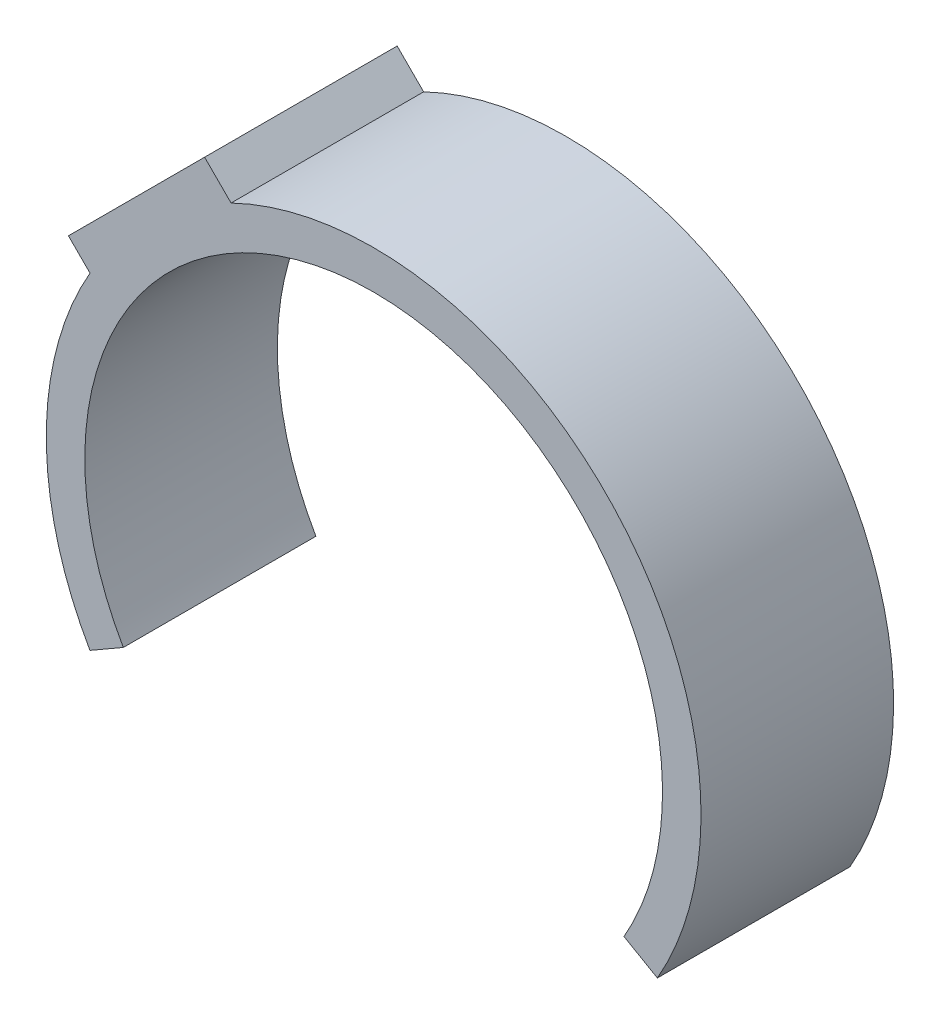
ISO-10303-21;
HEADER;
FILE_DESCRIPTION(('STEP AP214'),'2;1');
FILE_NAME('part.step','',(''),(''),'','','');
FILE_SCHEMA(('AUTOMOTIVE_DESIGN { 1 0 10303 214 1 1 1 1 }'));
ENDSEC;
DATA;
#1=APPLICATION_CONTEXT('core data for automotive mechanical design processes');
#2=APPLICATION_PROTOCOL_DEFINITION('international standard','automotive_design',2000,#1);
#3=PRODUCT_CONTEXT('',#1,'mechanical');
#4=PRODUCT('Part','Part','',(#3));
#5=PRODUCT_RELATED_PRODUCT_CATEGORY('part','',(#4));
#6=PRODUCT_DEFINITION_FORMATION('','',#4);
#7=PRODUCT_DEFINITION_CONTEXT('part definition',#1,'design');
#8=PRODUCT_DEFINITION('design','',#6,#7);
#9=PRODUCT_DEFINITION_SHAPE('','',#8);
#10=(LENGTH_UNIT() NAMED_UNIT(*) SI_UNIT(.MILLI.,.METRE.));
#11=(NAMED_UNIT(*) PLANE_ANGLE_UNIT() SI_UNIT($,.RADIAN.));
#12=(NAMED_UNIT(*) SI_UNIT($,.STERADIAN.) SOLID_ANGLE_UNIT());
#13=UNCERTAINTY_MEASURE_WITH_UNIT(LENGTH_MEASURE(1.E-05),#10,'distance_accuracy_value','');
#14=(GEOMETRIC_REPRESENTATION_CONTEXT(3) GLOBAL_UNCERTAINTY_ASSIGNED_CONTEXT((#13)) GLOBAL_UNIT_ASSIGNED_CONTEXT((#10,
#11,#12)) REPRESENTATION_CONTEXT('',''));
#15=CARTESIAN_POINT('',(0.,0.,0.));
#16=DIRECTION('',(0.,0.,1.));
#17=DIRECTION('',(1.,0.,0.));
#18=AXIS2_PLACEMENT_3D('',#15,#16,#17);
#19=CARTESIAN_POINT('',(0.,0.,5.));
#20=DIRECTION('',(0.,0.,-1.));
#21=DIRECTION('',(-1.,0.,0.));
#22=AXIS2_PLACEMENT_3D('',#19,#20,#21);
#23=CYLINDRICAL_SURFACE('',#22,8.5);
#24=DIRECTION('',(0.,0.,-1.));
#25=VECTOR('',#24,1.);
#26=CARTESIAN_POINT('',(-7.36513502441416,4.24320469364227,5.));
#27=LINE('',#26,#25);
#28=CARTESIAN_POINT('',(-7.36513502441416,4.24320469364227,0.));
#29=VERTEX_POINT('',#28);
#30=CARTESIAN_POINT('',(-7.36513502441416,4.24320469364227,5.));
#31=VERTEX_POINT('',#30);
#32=EDGE_CURVE('E125',#29,#31,#27,.F.);
#33=ORIENTED_EDGE('',*,*,#32,.F.);
#34=CARTESIAN_POINT('',(0.,0.,0.));
#35=DIRECTION('',(0.,0.,1.));
#36=DIRECTION('',(1.,0.,0.));
#37=AXIS2_PLACEMENT_3D('',#34,#35,#36);
#38=CIRCLE('',#37,8.5);
#39=CARTESIAN_POINT('',(-7.36666666666667,-4.2405450383438,0.));
#40=VERTEX_POINT('',#39);
#41=EDGE_CURVE('E148',#29,#40,#38,.T.);
#42=ORIENTED_EDGE('',*,*,#41,.T.);
#43=DIRECTION('',(0.,0.,-1.));
#44=VECTOR('',#43,1.);
#45=CARTESIAN_POINT('',(-7.36666666666667,-4.2405450383438,5.));
#46=LINE('',#45,#44);
#47=CARTESIAN_POINT('',(-7.36666666666667,-4.2405450383438,5.));
#48=VERTEX_POINT('',#47);
#49=EDGE_CURVE('E155',#48,#40,#46,.T.);
#50=ORIENTED_EDGE('',*,*,#49,.F.);
#51=CARTESIAN_POINT('',(0.,0.,5.));
#52=DIRECTION('',(0.,0.,1.));
#53=DIRECTION('',(-1.,0.,0.));
#54=AXIS2_PLACEMENT_3D('',#51,#52,#53);
#55=CIRCLE('',#54,8.5);
#56=EDGE_CURVE('E51',#31,#48,#55,.T.);
#57=ORIENTED_EDGE('',*,*,#56,.F.);
#58=EDGE_LOOP('',(#33,#42,#50,#57));
#59=FACE_BOUND('',#58,.T.);
#60=ADVANCED_FACE('F35',(#59),#23,.T.);
#61=DIRECTION('',(0.,0.,-1.));
#62=VECTOR('',#61,1.);
#63=CARTESIAN_POINT('',(-3.70223302531182,7.6513705064054,5.));
#64=LINE('',#63,#62);
#65=CARTESIAN_POINT('',(-3.70223302531182,7.6513705064054,5.));
#66=VERTEX_POINT('',#65);
#67=CARTESIAN_POINT('',(-3.70223302531182,7.6513705064054,0.));
#68=VERTEX_POINT('',#67);
#69=EDGE_CURVE('E59',#66,#68,#64,.T.);
#70=ORIENTED_EDGE('',*,*,#69,.F.);
#71=CARTESIAN_POINT('',(7.36666666666667,-4.2405450383438,5.));
#72=VERTEX_POINT('',#71);
#73=EDGE_CURVE('E139',#72,#66,#55,.T.);
#74=ORIENTED_EDGE('',*,*,#73,.F.);
#75=DIRECTION('',(0.,0.,-1.));
#76=VECTOR('',#75,1.);
#77=CARTESIAN_POINT('',(7.36666666666667,-4.2405450383438,5.));
#78=LINE('',#77,#76);
#79=CARTESIAN_POINT('',(7.36666666666667,-4.2405450383438,0.));
#80=VERTEX_POINT('',#79);
#81=EDGE_CURVE('E44',#72,#80,#78,.T.);
#82=ORIENTED_EDGE('',*,*,#81,.T.);
#83=EDGE_CURVE('E149',#80,#68,#38,.T.);
#84=ORIENTED_EDGE('',*,*,#83,.T.);
#85=EDGE_LOOP('',(#70,#74,#82,#84));
#86=FACE_BOUND('',#85,.T.);
#87=ADVANCED_FACE('F159',(#86),#23,.T.);
#88=CARTESIAN_POINT('',(0.,0.,5.));
#89=DIRECTION('',(0.,0.,-1.));
#90=DIRECTION('',(-1.,0.,0.));
#91=AXIS2_PLACEMENT_3D('',#88,#89,#90);
#92=CYLINDRICAL_SURFACE('',#91,7.5);
#93=CARTESIAN_POINT('',(-5.59622397497417,4.99322312959518,2.5));
#94=CARTESIAN_POINT('',(-5.59622301984301,4.9932246274667,2.54035225240046));
#95=CARTESIAN_POINT('',(-5.59395242177466,4.99577261875074,2.58073133606108));
#96=CARTESIAN_POINT('',(-5.58490814784261,5.00588106332854,2.66037296468261));
#97=CARTESIAN_POINT('',(-5.57812948073708,5.01344707244379,2.69963422170816));
#98=CARTESIAN_POINT('',(-5.56020682783536,5.03331679848212,2.77587765322124));
#99=CARTESIAN_POINT('',(-5.54906503741942,5.04561813269241,2.81286096308317));
#100=CARTESIAN_POINT('',(-5.52264755689196,5.07451922951719,2.883512294352));
#101=CARTESIAN_POINT('',(-5.50737275505629,5.09111806846952,2.91718102601714));
#102=CARTESIAN_POINT('',(-5.47299152033674,5.12805999907439,2.98030009774602));
#103=CARTESIAN_POINT('',(-5.4538807007314,5.14840737519923,3.00974554151394));
#104=CARTESIAN_POINT('',(-5.4122607416866,5.19214242424438,3.06353764951805));
#105=CARTESIAN_POINT('',(-5.38975150219589,5.21553018667244,3.08788416358868));
#106=CARTESIAN_POINT('',(-5.34187454500254,5.26455580465039,3.13077137792578));
#107=CARTESIAN_POINT('',(-5.3165084734814,5.29019236252093,3.14931539869883));
#108=CARTESIAN_POINT('',(-5.2635354746058,5.34290079314046,3.18008628460328));
#109=CARTESIAN_POINT('',(-5.23592860284217,5.36997263027658,3.19231330639442));
#110=CARTESIAN_POINT('',(-5.17928016534046,5.42462909154864,3.21007762769587));
#111=CARTESIAN_POINT('',(-5.15024301573413,5.45221199112,3.21563432143275));
#112=CARTESIAN_POINT('',(-5.09145610160089,5.50714926718288,3.21997322981008));
#113=CARTESIAN_POINT('',(-5.06170634186565,5.53450364520934,3.21875548998968));
#114=CARTESIAN_POINT('',(-5.00235295635031,5.58820782465406,3.20959520114679));
#115=CARTESIAN_POINT('',(-4.9727492909596,5.61455791305709,3.20165458853234));
#116=CARTESIAN_POINT('',(-4.91455286754396,5.66556868316055,3.17928988458511));
#117=CARTESIAN_POINT('',(-4.88596014261032,5.69022930958423,3.16486558123208));
#118=CARTESIAN_POINT('',(-4.83052231873327,5.73736749036329,3.12986341515455));
#119=CARTESIAN_POINT('',(-4.80368626410374,5.75983400146242,3.10925635680524));
#120=CARTESIAN_POINT('',(-4.7527601881553,5.8019275946725,3.06249441596664));
#121=CARTESIAN_POINT('',(-4.7286702595249,5.82155458094851,3.03633934630349));
#122=CARTESIAN_POINT('',(-4.68392546575323,5.85761669721644,2.97908097412041));
#123=CARTESIAN_POINT('',(-4.66328613693935,5.87403744396182,2.94795646309857));
#124=CARTESIAN_POINT('',(-4.62627861208284,5.90322823085291,2.88171172752744));
#125=CARTESIAN_POINT('',(-4.60991034920252,5.91599832812774,2.84659156551825));
#126=CARTESIAN_POINT('',(-4.58206852388352,5.93758865598971,2.77345332640532));
#127=CARTESIAN_POINT('',(-4.57058069931135,5.94642039946027,2.73544408127355));
#128=CARTESIAN_POINT('',(-4.55285251329233,5.96000502625014,2.65752091696342));
#129=CARTESIAN_POINT('',(-4.54661186311398,5.96475813400115,2.61760710271379));
#130=CARTESIAN_POINT('',(-4.53964049390611,5.97006562258165,2.53735252746317));
#131=CARTESIAN_POINT('',(-4.53886577107908,5.9706535357368,2.49701780043334));
#132=CARTESIAN_POINT('',(-4.54273866290039,5.96770736130637,2.41676219434863));
#133=CARTESIAN_POINT('',(-4.5473861480985,5.96417337212743,2.3768413054367));
#134=CARTESIAN_POINT('',(-4.56190547146195,5.95307489236482,2.29868245082438));
#135=CARTESIAN_POINT('',(-4.57175977269878,5.94552393065326,2.26043929987132));
#136=CARTESIAN_POINT('',(-4.59632513477003,5.92655335731293,2.18656187948897));
#137=CARTESIAN_POINT('',(-4.61103635263524,5.91513362060103,2.15092769445665));
#138=CARTESIAN_POINT('',(-4.6448955808097,5.88858291439236,2.08305940534708));
#139=CARTESIAN_POINT('',(-4.66406800700771,5.87343149394894,2.05084548695593));
#140=CARTESIAN_POINT('',(-4.7061514230644,5.83976567135017,1.99093279407399));
#141=CARTESIAN_POINT('',(-4.72906258953666,5.82125111031945,1.96323423300683));
#142=CARTESIAN_POINT('',(-4.77805642155987,5.78110589745383,1.91292499939908));
#143=CARTESIAN_POINT('',(-4.80416155664765,5.75945294443889,1.89035398967268));
#144=CARTESIAN_POINT('',(-4.85856651748994,5.71363234966302,1.8512036930145));
#145=CARTESIAN_POINT('',(-4.88686635313016,5.68946469657485,1.83462443307358));
#146=CARTESIAN_POINT('',(-4.94479882745488,5.63918746402185,1.80792700944059));
#147=CARTESIAN_POINT('',(-4.97443235919594,5.61307657546362,1.79781324614036));
#148=CARTESIAN_POINT('',(-5.03411482771441,5.5596125908704,1.78436922109995));
#149=CARTESIAN_POINT('',(-5.06416375128878,5.53225953425433,1.78103874425271));
#150=CARTESIAN_POINT('',(-5.12363522065379,5.47722511093531,1.78127078177177));
#151=CARTESIAN_POINT('',(-5.15306025365218,5.4495462758,1.78479660018875));
#152=CARTESIAN_POINT('',(-5.21062594588068,5.39453083374073,1.79857771055778));
#153=CARTESIAN_POINT('',(-5.23876663008492,5.36719422016978,1.80883287159836));
#154=CARTESIAN_POINT('',(-5.29291679613125,5.31380031305095,1.83573450621853));
#155=CARTESIAN_POINT('',(-5.31893355978078,5.28773878272683,1.85235792469558));
#156=CARTESIAN_POINT('',(-5.36829723434402,5.23761622097116,1.89152641029448));
#157=CARTESIAN_POINT('',(-5.39164421126794,5.21355514008272,1.91407133096232));
#158=CARTESIAN_POINT('',(-5.43515072082784,5.16818418943304,1.96448190556474));
#159=CARTESIAN_POINT('',(-5.4553055203009,5.1468784134925,1.99235532769192));
#160=CARTESIAN_POINT('',(-5.49194009187798,5.10776997188855,2.05262298493186));
#161=CARTESIAN_POINT('',(-5.50841897444276,5.08996815427426,2.08501831122855));
#162=CARTESIAN_POINT('',(-5.53738750727189,5.05843857693292,2.15351295434376));
#163=CARTESIAN_POINT('',(-5.54986485276908,5.04472339264138,2.18962325352653));
#164=CARTESIAN_POINT('',(-5.57049225513162,5.02193731489732,2.26441885619044));
#165=CARTESIAN_POINT('',(-5.57864710946619,5.01286127293012,2.30310125102625));
#166=CARTESIAN_POINT('',(-5.58844071053727,5.00193583550548,2.36833339757844));
#167=CARTESIAN_POINT('',(-5.59135652363697,4.99867391242038,2.39447059210757));
#168=CARTESIAN_POINT('',(-5.59524846804904,4.99431706937675,2.4470680089814));
#169=CARTESIAN_POINT('',(-5.59622460155658,4.9932221469658,2.4735282309605));
#170=CARTESIAN_POINT('',(-5.59622397497417,4.99322312959518,2.5));
#171=B_SPLINE_CURVE_WITH_KNOTS('',3,(#93,#94,#95,#96,#97,#98,#99,#100,#101,#102,#103,#104,#105,
#106,#107,#108,#109,#110,#111,#112,#113,#114,#115,#116,#117,#118,#119,#120,#121,#122,#123,#124,
#125,#126,#127,#128,#129,#130,#131,#132,#133,#134,#135,#136,#137,#138,#139,#140,#141,#142,#143,
#144,#145,#146,#147,#148,#149,#150,#151,#152,#153,#154,#155,#156,#157,#158,#159,#160,#161,#162,
#163,#164,#165,#166,#167,#168,#169,#170),.UNSPECIFIED.,.T.,.F.,(4,2,2,2,2,2,2,2,2,2,2,2,2,2,2,2,
2,2,2,2,2,2,2,2,2,2,2,2,2,2,2,2,2,2,2,2,2,2,4),(0.,0.120960301537204,0.242054751306442,
0.363088348457156,0.484095953436256,0.605242734585543,0.726393083055131,0.847473975283935,
0.968551864597797,1.08927685610179,1.21000103606815,1.33069045533314,1.45138382149572,
1.57265633273784,1.69393293601461,1.8157416820094,1.9375485217109,2.05899691435304,
2.18043862372734,2.30090153161289,2.42136156361595,2.54141843981883,2.66147919800559,
2.78221317315875,2.90295285329084,3.02459688760551,3.14624146987949,3.26796875508727,
3.38969218010049,3.51076591537911,3.63183729538008,3.75247443886567,3.87310859896463,
3.99391998640549,4.1147605774902,4.23596926888922,4.35704314935608,4.43639526971017,
4.51574730026014),.UNSPECIFIED.);
#172=CARTESIAN_POINT('',(-5.59622397497417,4.99322312959518,2.5));
#173=VERTEX_POINT('',#172);
#174=EDGE_CURVE('E122',#173,#173,#171,.T.);
#175=ORIENTED_EDGE('',*,*,#174,.T.);
#176=EDGE_LOOP('',(#175));
#177=FACE_BOUND('',#176,.T.);
#178=CARTESIAN_POINT('',(0.,0.,0.));
#179=DIRECTION('',(0.,0.,-1.));
#180=DIRECTION('',(-1.,0.,0.));
#181=AXIS2_PLACEMENT_3D('',#178,#179,#180);
#182=CIRCLE('',#181,7.5);
#183=CARTESIAN_POINT('',(-6.5,-3.74165738677394,0.));
#184=VERTEX_POINT('',#183);
#185=CARTESIAN_POINT('',(6.5,-3.74165738677394,0.));
#186=VERTEX_POINT('',#185);
#187=EDGE_CURVE('E133',#184,#186,#182,.T.);
#188=ORIENTED_EDGE('',*,*,#187,.T.);
#189=DIRECTION('',(0.,0.,-1.));
#190=VECTOR('',#189,1.);
#191=CARTESIAN_POINT('',(6.5,-3.74165738677394,5.));
#192=LINE('',#191,#190);
#193=CARTESIAN_POINT('',(6.5,-3.74165738677394,5.));
#194=VERTEX_POINT('',#193);
#195=EDGE_CURVE('E11',#194,#186,#192,.T.);
#196=ORIENTED_EDGE('',*,*,#195,.F.);
#197=CARTESIAN_POINT('',(0.,0.,5.));
#198=DIRECTION('',(0.,0.,-1.));
#199=DIRECTION('',(1.,0.,0.));
#200=AXIS2_PLACEMENT_3D('',#197,#198,#199);
#201=CIRCLE('',#200,7.5);
#202=CARTESIAN_POINT('',(-6.5,-3.74165738677394,5.));
#203=VERTEX_POINT('',#202);
#204=EDGE_CURVE('E134',#203,#194,#201,.T.);
#205=ORIENTED_EDGE('',*,*,#204,.F.);
#206=DIRECTION('',(0.,0.,-1.));
#207=VECTOR('',#206,1.);
#208=CARTESIAN_POINT('',(-6.5,-3.74165738677394,5.));
#209=LINE('',#208,#207);
#210=EDGE_CURVE('E143',#203,#184,#209,.T.);
#211=ORIENTED_EDGE('',*,*,#210,.T.);
#212=EDGE_LOOP('',(#188,#196,#205,#211));
#213=FACE_BOUND('',#212,.T.);
#214=ADVANCED_FACE('F37',(#177,#213),#92,.F.);
#215=CARTESIAN_POINT('',(7.36666666666667,-4.2405450383438,5.));
#216=DIRECTION('',(0.498887651569861,0.866666666666665,0.));
#217=DIRECTION('',(-0.866666666666665,0.498887651569861,0.));
#218=AXIS2_PLACEMENT_3D('',#215,#216,#217);
#219=PLANE('',#218);
#220=DIRECTION('',(0.866666666666665,-0.498887651569861,0.));
#221=VECTOR('',#220,1.);
#222=CARTESIAN_POINT('',(7.36666666666667,-4.2405450383438,0.));
#223=LINE('',#222,#221);
#224=EDGE_CURVE('E145',#186,#80,#223,.T.);
#225=ORIENTED_EDGE('',*,*,#224,.T.);
#226=ORIENTED_EDGE('',*,*,#81,.F.);
#227=DIRECTION('',(0.866666666666665,-0.498887651569861,0.));
#228=VECTOR('',#227,1.);
#229=CARTESIAN_POINT('',(7.36666666666667,-4.2405450383438,5.));
#230=LINE('',#229,#228);
#231=EDGE_CURVE('E136',#194,#72,#230,.T.);
#232=ORIENTED_EDGE('',*,*,#231,.F.);
#233=ORIENTED_EDGE('',*,*,#195,.T.);
#234=EDGE_LOOP('',(#225,#226,#232,#233));
#235=FACE_BOUND('',#234,.T.);
#236=ADVANCED_FACE('F162',(#235),#219,.F.);
#237=CARTESIAN_POINT('',(-7.36666666666667,-4.2405450383438,5.));
#238=DIRECTION('',(-0.498887651569859,0.866666666666667,0.));
#239=DIRECTION('',(-0.866666666666667,-0.498887651569859,0.));
#240=AXIS2_PLACEMENT_3D('',#237,#238,#239);
#241=PLANE('',#240);
#242=DIRECTION('',(0.866666666666667,0.498887651569859,0.));
#243=VECTOR('',#242,1.);
#244=CARTESIAN_POINT('',(-7.36666666666667,-4.2405450383438,0.));
#245=LINE('',#244,#243);
#246=EDGE_CURVE('E137',#40,#184,#245,.T.);
#247=ORIENTED_EDGE('',*,*,#246,.T.);
#248=ORIENTED_EDGE('',*,*,#210,.F.);
#249=DIRECTION('',(0.866666666666667,0.498887651569859,0.));
#250=VECTOR('',#249,1.);
#251=CARTESIAN_POINT('',(-7.36666666666667,-4.2405450383438,5.));
#252=LINE('',#251,#250);
#253=EDGE_CURVE('E141',#48,#203,#252,.T.);
#254=ORIENTED_EDGE('',*,*,#253,.F.);
#255=ORIENTED_EDGE('',*,*,#49,.T.);
#256=EDGE_LOOP('',(#247,#248,#254,#255));
#257=FACE_BOUND('',#256,.T.);
#258=ADVANCED_FACE('F198',(#257),#241,.F.);
#259=CARTESIAN_POINT('',(0.,0.,5.));
#260=DIRECTION('',(0.,0.,1.));
#261=DIRECTION('',(1.,0.,0.));
#262=AXIS2_PLACEMENT_3D('',#259,#260,#261);
#263=PLANE('',#262);
#264=ORIENTED_EDGE('',*,*,#73,.T.);
#265=DIRECTION('',(0.707106781186547,-0.707106781186548,0.));
#266=VECTOR('',#265,1.);
#267=CARTESIAN_POINT('',(-4.38939229013214,8.33852977122572,5.));
#268=LINE('',#267,#266);
#269=CARTESIAN_POINT('',(-4.38939229013214,8.33852977122572,5.));
#270=VERTEX_POINT('',#269);
#271=EDGE_CURVE('E109',#270,#66,#268,.T.);
#272=ORIENTED_EDGE('',*,*,#271,.F.);
#273=DIRECTION('',(0.707106781186548,0.707106781186547,0.));
#274=VECTOR('',#273,1.);
#275=CARTESIAN_POINT('',(-7.92492619606487,4.80299586529298,5.));
#276=LINE('',#275,#274);
#277=CARTESIAN_POINT('',(-7.92492619606487,4.80299586529298,5.));
#278=VERTEX_POINT('',#277);
#279=EDGE_CURVE('E103',#278,#270,#276,.T.);
#280=ORIENTED_EDGE('',*,*,#279,.F.);
#281=DIRECTION('',(0.707106781186547,-0.707106781186548,0.));
#282=VECTOR('',#281,1.);
#283=CARTESIAN_POINT('',(-7.92492619606487,4.80299586529298,5.));
#284=LINE('',#283,#282);
#285=EDGE_CURVE('E107',#278,#31,#284,.T.);
#286=ORIENTED_EDGE('',*,*,#285,.T.);
#287=ORIENTED_EDGE('',*,*,#56,.T.);
#288=ORIENTED_EDGE('',*,*,#253,.T.);
#289=ORIENTED_EDGE('',*,*,#204,.T.);
#290=ORIENTED_EDGE('',*,*,#231,.T.);
#291=EDGE_LOOP('',(#264,#272,#280,#286,#287,#288,#289,#290));
#292=FACE_BOUND('',#291,.T.);
#293=ADVANCED_FACE('F105',(#292),#263,.T.);
#294=CARTESIAN_POINT('',(0.,0.,0.));
#295=DIRECTION('',(0.,0.,1.));
#296=DIRECTION('',(1.,0.,0.));
#297=AXIS2_PLACEMENT_3D('',#294,#295,#296);
#298=PLANE('',#297);
#299=ORIENTED_EDGE('',*,*,#41,.F.);
#300=DIRECTION('',(0.707106781186547,-0.707106781186548,0.));
#301=VECTOR('',#300,1.);
#302=CARTESIAN_POINT('',(-7.92492619606487,4.80299586529298,0.));
#303=LINE('',#302,#301);
#304=CARTESIAN_POINT('',(-7.92492619606487,4.80299586529298,0.));
#305=VERTEX_POINT('',#304);
#306=EDGE_CURVE('E171',#305,#29,#303,.T.);
#307=ORIENTED_EDGE('',*,*,#306,.F.);
#308=DIRECTION('',(-0.707106781186548,-0.707106781186547,0.));
#309=VECTOR('',#308,1.);
#310=CARTESIAN_POINT('',(-7.92492619606487,4.80299586529298,0.));
#311=LINE('',#310,#309);
#312=CARTESIAN_POINT('',(-4.38939229013214,8.33852977122572,0.));
#313=VERTEX_POINT('',#312);
#314=EDGE_CURVE('E118',#313,#305,#311,.T.);
#315=ORIENTED_EDGE('',*,*,#314,.F.);
#316=DIRECTION('',(0.707106781186547,-0.707106781186548,0.));
#317=VECTOR('',#316,1.);
#318=CARTESIAN_POINT('',(-4.38939229013214,8.33852977122572,0.));
#319=LINE('',#318,#317);
#320=EDGE_CURVE('E128',#313,#68,#319,.T.);
#321=ORIENTED_EDGE('',*,*,#320,.T.);
#322=ORIENTED_EDGE('',*,*,#83,.F.);
#323=ORIENTED_EDGE('',*,*,#224,.F.);
#324=ORIENTED_EDGE('',*,*,#187,.F.);
#325=ORIENTED_EDGE('',*,*,#246,.F.);
#326=EDGE_LOOP('',(#299,#307,#315,#321,#322,#323,#324,#325));
#327=FACE_BOUND('',#326,.T.);
#328=ADVANCED_FACE('F166',(#327),#298,.F.);
#329=CARTESIAN_POINT('',(-7.92492619606487,4.80299586529298,0.));
#330=DIRECTION('',(0.707106781186548,0.707106781186547,0.));
#331=DIRECTION('',(-0.707106781186547,0.707106781186548,0.));
#332=AXIS2_PLACEMENT_3D('',#329,#330,#331);
#333=PLANE('',#332);
#334=ORIENTED_EDGE('',*,*,#306,.T.);
#335=ORIENTED_EDGE('',*,*,#32,.T.);
#336=ORIENTED_EDGE('',*,*,#285,.F.);
#337=DIRECTION('',(0.,0.,1.));
#338=VECTOR('',#337,1.);
#339=CARTESIAN_POINT('',(-7.92492619606487,4.80299586529298,0.));
#340=LINE('',#339,#338);
#341=EDGE_CURVE('E113',#305,#278,#340,.T.);
#342=ORIENTED_EDGE('',*,*,#341,.F.);
#343=EDGE_LOOP('',(#334,#335,#336,#342));
#344=FACE_BOUND('',#343,.T.);
#345=ADVANCED_FACE('F124',(#344),#333,.F.);
#346=CARTESIAN_POINT('',(-4.38939229013214,8.33852977122572,0.));
#347=DIRECTION('',(-0.707106781186548,-0.707106781186547,0.));
#348=DIRECTION('',(0.707106781186547,-0.707106781186548,0.));
#349=AXIS2_PLACEMENT_3D('',#346,#347,#348);
#350=PLANE('',#349);
#351=ORIENTED_EDGE('',*,*,#271,.T.);
#352=ORIENTED_EDGE('',*,*,#69,.T.);
#353=ORIENTED_EDGE('',*,*,#320,.F.);
#354=DIRECTION('',(0.,0.,-1.));
#355=VECTOR('',#354,1.);
#356=CARTESIAN_POINT('',(-4.38939229013214,8.33852977122572,0.));
#357=LINE('',#356,#355);
#358=EDGE_CURVE('E112',#270,#313,#357,.T.);
#359=ORIENTED_EDGE('',*,*,#358,.F.);
#360=EDGE_LOOP('',(#351,#352,#353,#359));
#361=FACE_BOUND('',#360,.T.);
#362=ADVANCED_FACE('F190',(#361),#350,.F.);
#363=CARTESIAN_POINT('',(-6.36396103067893,6.36396103067893,0.));
#364=DIRECTION('',(-0.707106781186547,0.707106781186548,0.));
#365=DIRECTION('',(-0.707106781186548,-0.707106781186547,0.));
#366=AXIS2_PLACEMENT_3D('',#363,#364,#365);
#367=PLANE('',#366);
#368=CARTESIAN_POINT('',(-6.15715924309851,6.57076281825935,2.5));
#369=DIRECTION('',(-0.707106781186548,0.707106781186548,0.));
#370=DIRECTION('',(-0.707106781186548,-0.707106781186548,0.));
#371=AXIS2_PLACEMENT_3D('',#368,#369,#370);
#372=CIRCLE('',#371,0.718847879547936);
#373=CARTESIAN_POINT('',(-6.66546145336842,6.06246060798944,2.5));
#374=VERTEX_POINT('',#373);
#375=EDGE_CURVE('E182',#374,#374,#372,.T.);
#376=ORIENTED_EDGE('',*,*,#375,.F.);
#377=EDGE_LOOP('',(#376));
#378=FACE_BOUND('',#377,.T.);
#379=ORIENTED_EDGE('',*,*,#341,.T.);
#380=ORIENTED_EDGE('',*,*,#279,.T.);
#381=ORIENTED_EDGE('',*,*,#358,.T.);
#382=ORIENTED_EDGE('',*,*,#314,.T.);
#383=EDGE_LOOP('',(#379,#380,#381,#382));
#384=FACE_BOUND('',#383,.T.);
#385=ADVANCED_FACE('F116',(#378,#384),#367,.T.);
#386=CARTESIAN_POINT('',(-2.62162533716577,3.03522891232661,2.5));
#387=DIRECTION('',(-0.707106781186548,0.707106781186548,0.));
#388=DIRECTION('',(-0.707106781186548,-0.707106781186548,0.));
#389=AXIS2_PLACEMENT_3D('',#386,#387,#388);
#390=CYLINDRICAL_SURFACE('',#389,0.718847879547936);
#391=ORIENTED_EDGE('',*,*,#375,.T.);
#392=EDGE_LOOP('',(#391));
#393=FACE_BOUND('',#392,.T.);
#394=ORIENTED_EDGE('',*,*,#174,.F.);
#395=EDGE_LOOP('',(#394));
#396=FACE_BOUND('',#395,.T.);
#397=ADVANCED_FACE('F183',(#393,#396),#390,.F.);
#398=CLOSED_SHELL('',(#60,#87,#214,#236,#258,#293,#328,#345,#362,#385,#397));
#399=MANIFOLD_SOLID_BREP('B2',#398);
#400=ADVANCED_BREP_SHAPE_REPRESENTATION('',(#18,#399),#14);
#401=SHAPE_DEFINITION_REPRESENTATION(#9,#400);
ENDSEC;
END-ISO-10303-21;
